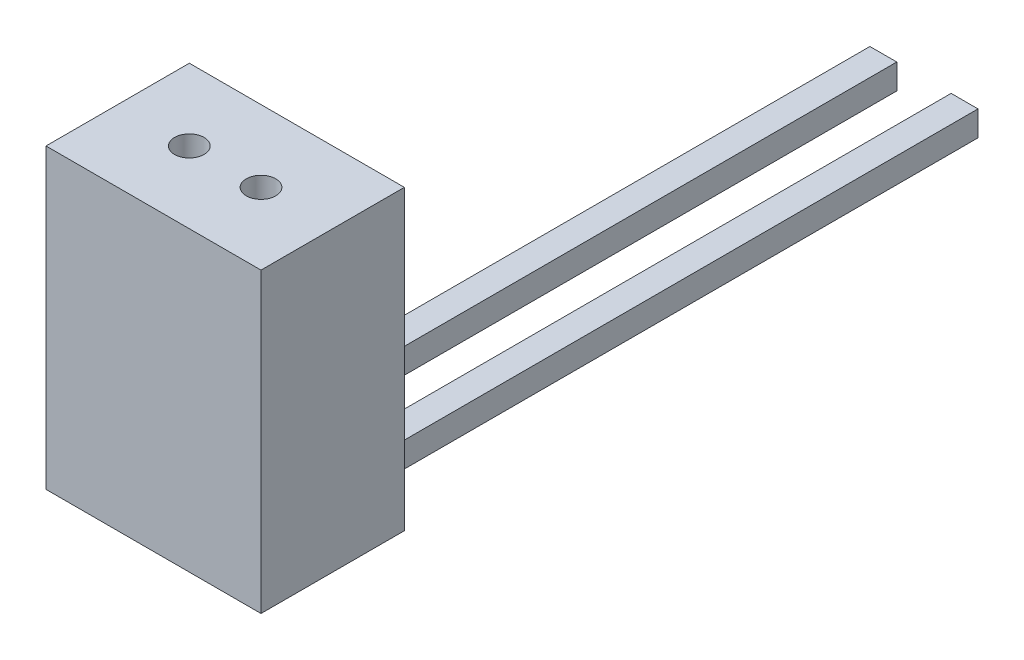
ISO-10303-21;
HEADER;
FILE_DESCRIPTION(('STEP AP214'),'2;1');
FILE_NAME('part.step','',(''),(''),'','','');
FILE_SCHEMA(('AUTOMOTIVE_DESIGN { 1 0 10303 214 1 1 1 1 }'));
ENDSEC;
DATA;
#1=APPLICATION_CONTEXT('core data for automotive mechanical design processes');
#2=APPLICATION_PROTOCOL_DEFINITION('international standard','automotive_design',2000,#1);
#3=PRODUCT_CONTEXT('',#1,'mechanical');
#4=PRODUCT('Part','Part','',(#3));
#5=PRODUCT_RELATED_PRODUCT_CATEGORY('part','',(#4));
#6=PRODUCT_DEFINITION_FORMATION('','',#4);
#7=PRODUCT_DEFINITION_CONTEXT('part definition',#1,'design');
#8=PRODUCT_DEFINITION('design','',#6,#7);
#9=PRODUCT_DEFINITION_SHAPE('','',#8);
#10=(LENGTH_UNIT() NAMED_UNIT(*) SI_UNIT(.MILLI.,.METRE.));
#11=(NAMED_UNIT(*) PLANE_ANGLE_UNIT() SI_UNIT($,.RADIAN.));
#12=(NAMED_UNIT(*) SI_UNIT($,.STERADIAN.) SOLID_ANGLE_UNIT());
#13=UNCERTAINTY_MEASURE_WITH_UNIT(LENGTH_MEASURE(1.E-05),#10,'distance_accuracy_value','');
#14=(GEOMETRIC_REPRESENTATION_CONTEXT(3) GLOBAL_UNCERTAINTY_ASSIGNED_CONTEXT((#13)) GLOBAL_UNIT_ASSIGNED_CONTEXT((#10,
#11,#12)) REPRESENTATION_CONTEXT('',''));
#15=CARTESIAN_POINT('',(0.,0.,0.));
#16=DIRECTION('',(0.,0.,1.));
#17=DIRECTION('',(1.,0.,0.));
#18=AXIS2_PLACEMENT_3D('',#15,#16,#17);
#19=CARTESIAN_POINT('',(16.,33.2,8.));
#20=DIRECTION('',(0.,-1.,0.));
#21=DIRECTION('',(0.,0.,-1.));
#22=AXIS2_PLACEMENT_3D('',#19,#20,#21);
#23=CYLINDRICAL_SURFACE('',#22,1.65);
#24=CARTESIAN_POINT('',(16.,0.,8.));
#25=DIRECTION('',(0.,1.,0.));
#26=DIRECTION('',(0.,0.,1.));
#27=AXIS2_PLACEMENT_3D('',#24,#25,#26);
#28=CIRCLE('',#27,1.65);
#29=CARTESIAN_POINT('',(16.,0.,9.65));
#30=VERTEX_POINT('',#29);
#31=EDGE_CURVE('E295',#30,#30,#28,.T.);
#32=ORIENTED_EDGE('',*,*,#31,.F.);
#33=EDGE_LOOP('',(#32));
#34=FACE_BOUND('',#33,.T.);
#35=CARTESIAN_POINT('',(16.,3.,8.));
#36=DIRECTION('',(0.,1.,0.));
#37=DIRECTION('',(0.,0.,1.));
#38=AXIS2_PLACEMENT_3D('',#35,#36,#37);
#39=CIRCLE('',#38,1.65);
#40=CARTESIAN_POINT('',(16.,3.,9.65));
#41=VERTEX_POINT('',#40);
#42=EDGE_CURVE('E383',#41,#41,#39,.T.);
#43=ORIENTED_EDGE('',*,*,#42,.T.);
#44=EDGE_LOOP('',(#43));
#45=FACE_BOUND('',#44,.T.);
#46=ADVANCED_FACE('F38',(#34,#45),#23,.F.);
#47=CARTESIAN_POINT('',(8.,33.2,8.));
#48=DIRECTION('',(0.,-1.,0.));
#49=DIRECTION('',(0.,0.,-1.));
#50=AXIS2_PLACEMENT_3D('',#47,#48,#49);
#51=CYLINDRICAL_SURFACE('',#50,1.65);
#52=CARTESIAN_POINT('',(8.,0.,8.));
#53=DIRECTION('',(0.,1.,0.));
#54=DIRECTION('',(0.,0.,1.));
#55=AXIS2_PLACEMENT_3D('',#52,#53,#54);
#56=CIRCLE('',#55,1.65);
#57=CARTESIAN_POINT('',(8.,0.,9.65000000000001));
#58=VERTEX_POINT('',#57);
#59=EDGE_CURVE('E292',#58,#58,#56,.T.);
#60=ORIENTED_EDGE('',*,*,#59,.F.);
#61=EDGE_LOOP('',(#60));
#62=FACE_BOUND('',#61,.T.);
#63=CARTESIAN_POINT('',(8.,3.,8.));
#64=DIRECTION('',(0.,1.,0.));
#65=DIRECTION('',(0.,0.,1.));
#66=AXIS2_PLACEMENT_3D('',#63,#64,#65);
#67=CIRCLE('',#66,1.65);
#68=CARTESIAN_POINT('',(8.,3.,9.65000000000001));
#69=VERTEX_POINT('',#68);
#70=EDGE_CURVE('E233',#69,#69,#67,.T.);
#71=ORIENTED_EDGE('',*,*,#70,.T.);
#72=EDGE_LOOP('',(#71));
#73=FACE_BOUND('',#72,.T.);
#74=ADVANCED_FACE('F450',(#62,#73),#51,.F.);
#75=CARTESIAN_POINT('',(8.96666666666667,2.8,-70.));
#76=DIRECTION('',(1.,0.,0.));
#77=DIRECTION('',(0.,0.,-1.));
#78=AXIS2_PLACEMENT_3D('',#75,#76,#77);
#79=PLANE('',#78);
#80=DIRECTION('',(0.,1.,0.));
#81=VECTOR('',#80,1.);
#82=CARTESIAN_POINT('',(8.96666666666667,2.8,0.));
#83=LINE('',#82,#81);
#84=CARTESIAN_POINT('',(8.96666666666667,0.,0.));
#85=VERTEX_POINT('',#84);
#86=CARTESIAN_POINT('',(8.96666666666667,2.8,0.));
#87=VERTEX_POINT('',#86);
#88=EDGE_CURVE('E360',#85,#87,#83,.T.);
#89=ORIENTED_EDGE('',*,*,#88,.F.);
#90=DIRECTION('',(0.,0.,1.));
#91=VECTOR('',#90,1.);
#92=CARTESIAN_POINT('',(8.96666666666667,0.,-70.));
#93=LINE('',#92,#91);
#94=CARTESIAN_POINT('',(8.96666666666667,0.,-70.));
#95=VERTEX_POINT('',#94);
#96=EDGE_CURVE('E11',#95,#85,#93,.T.);
#97=ORIENTED_EDGE('',*,*,#96,.F.);
#98=DIRECTION('',(0.,1.,0.));
#99=VECTOR('',#98,1.);
#100=CARTESIAN_POINT('',(8.96666666666667,2.8,-70.));
#101=LINE('',#100,#99);
#102=CARTESIAN_POINT('',(8.96666666666667,2.8,-70.));
#103=VERTEX_POINT('',#102);
#104=EDGE_CURVE('E361',#95,#103,#101,.T.);
#105=ORIENTED_EDGE('',*,*,#104,.T.);
#106=DIRECTION('',(0.,0.,1.));
#107=VECTOR('',#106,1.);
#108=CARTESIAN_POINT('',(8.96666666666667,2.8,-70.));
#109=LINE('',#108,#107);
#110=EDGE_CURVE('E85',#103,#87,#109,.T.);
#111=ORIENTED_EDGE('',*,*,#110,.T.);
#112=EDGE_LOOP('',(#89,#97,#105,#111));
#113=FACE_BOUND('',#112,.T.);
#114=ADVANCED_FACE('F40',(#113),#79,.T.);
#115=CARTESIAN_POINT('',(5.96666666666667,0.,-70.));
#116=DIRECTION('',(0.,-1.,0.));
#117=DIRECTION('',(0.,0.,-1.));
#118=AXIS2_PLACEMENT_3D('',#115,#116,#117);
#119=PLANE('',#118);
#120=ORIENTED_EDGE('',*,*,#59,.T.);
#121=EDGE_LOOP('',(#120));
#122=FACE_BOUND('',#121,.T.);
#123=ORIENTED_EDGE('',*,*,#31,.T.);
#124=EDGE_LOOP('',(#123));
#125=FACE_BOUND('',#124,.T.);
#126=ORIENTED_EDGE('',*,*,#96,.T.);
#127=DIRECTION('',(1.,0.,0.));
#128=VECTOR('',#127,1.);
#129=CARTESIAN_POINT('',(0.,0.,0.));
#130=LINE('',#129,#128);
#131=CARTESIAN_POINT('',(15.0333333333333,0.,0.));
#132=VERTEX_POINT('',#131);
#133=EDGE_CURVE('E346',#85,#132,#130,.T.);
#134=ORIENTED_EDGE('',*,*,#133,.T.);
#135=DIRECTION('',(0.,0.,1.));
#136=VECTOR('',#135,1.);
#137=CARTESIAN_POINT('',(15.0333333333333,0.,-70.));
#138=LINE('',#137,#136);
#139=CARTESIAN_POINT('',(15.0333333333333,0.,-70.));
#140=VERTEX_POINT('',#139);
#141=EDGE_CURVE('E306',#140,#132,#138,.T.);
#142=ORIENTED_EDGE('',*,*,#141,.F.);
#143=DIRECTION('',(1.,0.,0.));
#144=VECTOR('',#143,1.);
#145=CARTESIAN_POINT('',(15.0333333333333,0.,-70.));
#146=LINE('',#145,#144);
#147=CARTESIAN_POINT('',(18.0333333333333,0.,-70.));
#148=VERTEX_POINT('',#147);
#149=EDGE_CURVE('E303',#140,#148,#146,.T.);
#150=ORIENTED_EDGE('',*,*,#149,.T.);
#151=DIRECTION('',(0.,0.,1.));
#152=VECTOR('',#151,1.);
#153=CARTESIAN_POINT('',(18.0333333333333,0.,-70.));
#154=LINE('',#153,#152);
#155=CARTESIAN_POINT('',(18.0333333333333,0.,0.));
#156=VERTEX_POINT('',#155);
#157=EDGE_CURVE('E291',#148,#156,#154,.T.);
#158=ORIENTED_EDGE('',*,*,#157,.T.);
#159=CARTESIAN_POINT('',(24.,0.,0.));
#160=VERTEX_POINT('',#159);
#161=EDGE_CURVE('E341',#156,#160,#130,.T.);
#162=ORIENTED_EDGE('',*,*,#161,.T.);
#163=DIRECTION('',(0.,0.,-1.));
#164=VECTOR('',#163,1.);
#165=CARTESIAN_POINT('',(24.,0.,16.));
#166=LINE('',#165,#164);
#167=CARTESIAN_POINT('',(24.,0.,16.));
#168=VERTEX_POINT('',#167);
#169=EDGE_CURVE('E354',#168,#160,#166,.T.);
#170=ORIENTED_EDGE('',*,*,#169,.F.);
#171=DIRECTION('',(1.,0.,0.));
#172=VECTOR('',#171,1.);
#173=CARTESIAN_POINT('',(0.,0.,16.));
#174=LINE('',#173,#172);
#175=CARTESIAN_POINT('',(0.,0.,16.));
#176=VERTEX_POINT('',#175);
#177=EDGE_CURVE('E331',#176,#168,#174,.T.);
#178=ORIENTED_EDGE('',*,*,#177,.F.);
#179=DIRECTION('',(0.,0.,-1.));
#180=VECTOR('',#179,1.);
#181=CARTESIAN_POINT('',(0.,0.,16.));
#182=LINE('',#181,#180);
#183=CARTESIAN_POINT('',(0.,0.,0.));
#184=VERTEX_POINT('',#183);
#185=EDGE_CURVE('E357',#176,#184,#182,.T.);
#186=ORIENTED_EDGE('',*,*,#185,.T.);
#187=CARTESIAN_POINT('',(5.96666666666667,0.,0.));
#188=VERTEX_POINT('',#187);
#189=EDGE_CURVE('E342',#184,#188,#130,.T.);
#190=ORIENTED_EDGE('',*,*,#189,.T.);
#191=DIRECTION('',(0.,0.,1.));
#192=VECTOR('',#191,1.);
#193=CARTESIAN_POINT('',(5.96666666666667,0.,-70.));
#194=LINE('',#193,#192);
#195=CARTESIAN_POINT('',(5.96666666666667,0.,-70.));
#196=VERTEX_POINT('',#195);
#197=EDGE_CURVE('E47',#196,#188,#194,.T.);
#198=ORIENTED_EDGE('',*,*,#197,.F.);
#199=DIRECTION('',(1.,0.,0.));
#200=VECTOR('',#199,1.);
#201=CARTESIAN_POINT('',(5.96666666666667,0.,-70.));
#202=LINE('',#201,#200);
#203=EDGE_CURVE('E369',#196,#95,#202,.T.);
#204=ORIENTED_EDGE('',*,*,#203,.T.);
#205=EDGE_LOOP('',(#126,#134,#142,#150,#158,#162,#170,#178,#186,#190,#198,#204));
#206=FACE_BOUND('',#205,.T.);
#207=ADVANCED_FACE('F422',(#122,#125,#206),#119,.T.);
#208=CARTESIAN_POINT('',(5.96666666666667,0.,-70.));
#209=DIRECTION('',(-1.,0.,0.));
#210=DIRECTION('',(0.,0.,1.));
#211=AXIS2_PLACEMENT_3D('',#208,#209,#210);
#212=PLANE('',#211);
#213=DIRECTION('',(0.,-1.,0.));
#214=VECTOR('',#213,1.);
#215=CARTESIAN_POINT('',(5.96666666666667,0.,0.));
#216=LINE('',#215,#214);
#217=CARTESIAN_POINT('',(5.96666666666667,2.8,0.));
#218=VERTEX_POINT('',#217);
#219=EDGE_CURVE('E364',#218,#188,#216,.T.);
#220=ORIENTED_EDGE('',*,*,#219,.F.);
#221=DIRECTION('',(0.,0.,1.));
#222=VECTOR('',#221,1.);
#223=CARTESIAN_POINT('',(5.96666666666667,2.8,-70.));
#224=LINE('',#223,#222);
#225=CARTESIAN_POINT('',(5.96666666666667,2.8,-70.));
#226=VERTEX_POINT('',#225);
#227=EDGE_CURVE('E379',#226,#218,#224,.T.);
#228=ORIENTED_EDGE('',*,*,#227,.F.);
#229=DIRECTION('',(0.,-1.,0.));
#230=VECTOR('',#229,1.);
#231=CARTESIAN_POINT('',(5.96666666666667,0.,-70.));
#232=LINE('',#231,#230);
#233=EDGE_CURVE('E366',#226,#196,#232,.T.);
#234=ORIENTED_EDGE('',*,*,#233,.T.);
#235=ORIENTED_EDGE('',*,*,#197,.T.);
#236=EDGE_LOOP('',(#220,#228,#234,#235));
#237=FACE_BOUND('',#236,.T.);
#238=ADVANCED_FACE('F705',(#237),#212,.T.);
#239=CARTESIAN_POINT('',(5.96666666666667,2.8,-70.));
#240=DIRECTION('',(0.,1.,0.));
#241=DIRECTION('',(0.,0.,1.));
#242=AXIS2_PLACEMENT_3D('',#239,#240,#241);
#243=PLANE('',#242);
#244=DIRECTION('',(-1.,0.,0.));
#245=VECTOR('',#244,1.);
#246=CARTESIAN_POINT('',(5.96666666666667,2.8,0.));
#247=LINE('',#246,#245);
#248=EDGE_CURVE('E373',#87,#218,#247,.T.);
#249=ORIENTED_EDGE('',*,*,#248,.F.);
#250=ORIENTED_EDGE('',*,*,#110,.F.);
#251=DIRECTION('',(-1.,0.,0.));
#252=VECTOR('',#251,1.);
#253=CARTESIAN_POINT('',(5.96666666666667,2.8,-70.));
#254=LINE('',#253,#252);
#255=EDGE_CURVE('E363',#103,#226,#254,.T.);
#256=ORIENTED_EDGE('',*,*,#255,.T.);
#257=ORIENTED_EDGE('',*,*,#227,.T.);
#258=EDGE_LOOP('',(#249,#250,#256,#257));
#259=FACE_BOUND('',#258,.T.);
#260=ADVANCED_FACE('F696',(#259),#243,.T.);
#261=CARTESIAN_POINT('',(0.,0.,-70.));
#262=DIRECTION('',(0.,0.,1.));
#263=DIRECTION('',(1.,0.,0.));
#264=AXIS2_PLACEMENT_3D('',#261,#262,#263);
#265=PLANE('',#264);
#266=ORIENTED_EDGE('',*,*,#104,.F.);
#267=ORIENTED_EDGE('',*,*,#203,.F.);
#268=ORIENTED_EDGE('',*,*,#233,.F.);
#269=ORIENTED_EDGE('',*,*,#255,.F.);
#270=EDGE_LOOP('',(#266,#267,#268,#269));
#271=FACE_BOUND('',#270,.T.);
#272=ADVANCED_FACE('F660',(#271),#265,.F.);
#273=CARTESIAN_POINT('',(0.,0.,0.));
#274=DIRECTION('',(0.,0.,1.));
#275=DIRECTION('',(1.,0.,0.));
#276=AXIS2_PLACEMENT_3D('',#273,#274,#275);
#277=PLANE('',#276);
#278=ORIENTED_EDGE('',*,*,#161,.F.);
#279=DIRECTION('',(0.,1.,0.));
#280=VECTOR('',#279,1.);
#281=CARTESIAN_POINT('',(18.0333333333333,2.8,0.));
#282=LINE('',#281,#280);
#283=CARTESIAN_POINT('',(18.0333333333333,2.8,0.));
#284=VERTEX_POINT('',#283);
#285=EDGE_CURVE('E314',#156,#284,#282,.T.);
#286=ORIENTED_EDGE('',*,*,#285,.T.);
#287=DIRECTION('',(-1.,0.,0.));
#288=VECTOR('',#287,1.);
#289=CARTESIAN_POINT('',(15.0333333333333,2.8,0.));
#290=LINE('',#289,#288);
#291=CARTESIAN_POINT('',(15.0333333333333,2.8,0.));
#292=VERTEX_POINT('',#291);
#293=EDGE_CURVE('E310',#284,#292,#290,.T.);
#294=ORIENTED_EDGE('',*,*,#293,.T.);
#295=DIRECTION('',(0.,-1.,0.));
#296=VECTOR('',#295,1.);
#297=CARTESIAN_POINT('',(15.0333333333333,0.,0.));
#298=LINE('',#297,#296);
#299=EDGE_CURVE('E55',#292,#132,#298,.T.);
#300=ORIENTED_EDGE('',*,*,#299,.T.);
#301=ORIENTED_EDGE('',*,*,#133,.F.);
#302=ORIENTED_EDGE('',*,*,#88,.T.);
#303=ORIENTED_EDGE('',*,*,#248,.T.);
#304=ORIENTED_EDGE('',*,*,#219,.T.);
#305=ORIENTED_EDGE('',*,*,#189,.F.);
#306=DIRECTION('',(0.,-1.,0.));
#307=VECTOR('',#306,1.);
#308=CARTESIAN_POINT('',(0.,33.2,0.));
#309=LINE('',#308,#307);
#310=CARTESIAN_POINT('',(0.,33.2,0.));
#311=VERTEX_POINT('',#310);
#312=EDGE_CURVE('E317',#311,#184,#309,.T.);
#313=ORIENTED_EDGE('',*,*,#312,.F.);
#314=DIRECTION('',(-1.,0.,0.));
#315=VECTOR('',#314,1.);
#316=CARTESIAN_POINT('',(24.,33.2,0.));
#317=LINE('',#316,#315);
#318=CARTESIAN_POINT('',(24.,33.2,0.));
#319=VERTEX_POINT('',#318);
#320=EDGE_CURVE('E332',#319,#311,#317,.T.);
#321=ORIENTED_EDGE('',*,*,#320,.F.);
#322=DIRECTION('',(0.,1.,0.));
#323=VECTOR('',#322,1.);
#324=CARTESIAN_POINT('',(24.,0.,0.));
#325=LINE('',#324,#323);
#326=EDGE_CURVE('E345',#160,#319,#325,.T.);
#327=ORIENTED_EDGE('',*,*,#326,.F.);
#328=EDGE_LOOP('',(#278,#286,#294,#300,#301,#302,#303,#304,#305,#313,#321,#327));
#329=FACE_BOUND('',#328,.T.);
#330=ADVANCED_FACE('F420',(#329),#277,.F.);
#331=CARTESIAN_POINT('',(0.,33.2,16.));
#332=DIRECTION('',(1.,0.,0.));
#333=DIRECTION('',(0.,1.,0.));
#334=AXIS2_PLACEMENT_3D('',#331,#332,#333);
#335=PLANE('',#334);
#336=ORIENTED_EDGE('',*,*,#312,.T.);
#337=ORIENTED_EDGE('',*,*,#185,.F.);
#338=DIRECTION('',(0.,-1.,0.));
#339=VECTOR('',#338,1.);
#340=CARTESIAN_POINT('',(0.,33.2,16.));
#341=LINE('',#340,#339);
#342=CARTESIAN_POINT('',(0.,33.2,16.));
#343=VERTEX_POINT('',#342);
#344=EDGE_CURVE('E328',#343,#176,#341,.T.);
#345=ORIENTED_EDGE('',*,*,#344,.F.);
#346=DIRECTION('',(0.,0.,-1.));
#347=VECTOR('',#346,1.);
#348=CARTESIAN_POINT('',(0.,33.2,16.));
#349=LINE('',#348,#347);
#350=EDGE_CURVE('E338',#343,#311,#349,.T.);
#351=ORIENTED_EDGE('',*,*,#350,.T.);
#352=EDGE_LOOP('',(#336,#337,#345,#351));
#353=FACE_BOUND('',#352,.T.);
#354=ADVANCED_FACE('F417',(#353),#335,.F.);
#355=CARTESIAN_POINT('',(24.,0.,16.));
#356=DIRECTION('',(-1.,0.,0.));
#357=DIRECTION('',(0.,0.,1.));
#358=AXIS2_PLACEMENT_3D('',#355,#356,#357);
#359=PLANE('',#358);
#360=ORIENTED_EDGE('',*,*,#326,.T.);
#361=DIRECTION('',(0.,0.,-1.));
#362=VECTOR('',#361,1.);
#363=CARTESIAN_POINT('',(24.,33.2,16.));
#364=LINE('',#363,#362);
#365=CARTESIAN_POINT('',(24.,33.2,16.));
#366=VERTEX_POINT('',#365);
#367=EDGE_CURVE('E351',#366,#319,#364,.T.);
#368=ORIENTED_EDGE('',*,*,#367,.F.);
#369=DIRECTION('',(0.,1.,0.));
#370=VECTOR('',#369,1.);
#371=CARTESIAN_POINT('',(24.,0.,16.));
#372=LINE('',#371,#370);
#373=EDGE_CURVE('E334',#168,#366,#372,.T.);
#374=ORIENTED_EDGE('',*,*,#373,.F.);
#375=ORIENTED_EDGE('',*,*,#169,.T.);
#376=EDGE_LOOP('',(#360,#368,#374,#375));
#377=FACE_BOUND('',#376,.T.);
#378=ADVANCED_FACE('F405',(#377),#359,.F.);
#379=CARTESIAN_POINT('',(24.,33.2,16.));
#380=DIRECTION('',(0.,-1.,0.));
#381=DIRECTION('',(1.,0.,0.));
#382=AXIS2_PLACEMENT_3D('',#379,#380,#381);
#383=PLANE('',#382);
#384=CARTESIAN_POINT('',(8.,33.2,8.));
#385=DIRECTION('',(0.,1.,0.));
#386=DIRECTION('',(0.,0.,1.));
#387=AXIS2_PLACEMENT_3D('',#384,#385,#386);
#388=CIRCLE('',#387,1.65);
#389=CARTESIAN_POINT('',(8.,33.2,9.65000000000001));
#390=VERTEX_POINT('',#389);
#391=EDGE_CURVE('E288',#390,#390,#388,.T.);
#392=ORIENTED_EDGE('',*,*,#391,.F.);
#393=EDGE_LOOP('',(#392));
#394=FACE_BOUND('',#393,.T.);
#395=CARTESIAN_POINT('',(16.,33.2,8.));
#396=DIRECTION('',(0.,1.,0.));
#397=DIRECTION('',(0.,0.,1.));
#398=AXIS2_PLACEMENT_3D('',#395,#396,#397);
#399=CIRCLE('',#398,1.65);
#400=CARTESIAN_POINT('',(16.,33.2,9.65));
#401=VERTEX_POINT('',#400);
#402=EDGE_CURVE('E298',#401,#401,#399,.T.);
#403=ORIENTED_EDGE('',*,*,#402,.F.);
#404=EDGE_LOOP('',(#403));
#405=FACE_BOUND('',#404,.T.);
#406=ORIENTED_EDGE('',*,*,#320,.T.);
#407=ORIENTED_EDGE('',*,*,#350,.F.);
#408=DIRECTION('',(-1.,0.,0.));
#409=VECTOR('',#408,1.);
#410=CARTESIAN_POINT('',(24.,33.2,16.));
#411=LINE('',#410,#409);
#412=EDGE_CURVE('E336',#366,#343,#411,.T.);
#413=ORIENTED_EDGE('',*,*,#412,.F.);
#414=ORIENTED_EDGE('',*,*,#367,.T.);
#415=EDGE_LOOP('',(#406,#407,#413,#414));
#416=FACE_BOUND('',#415,.T.);
#417=ADVANCED_FACE('F401',(#394,#405,#416),#383,.F.);
#418=CARTESIAN_POINT('',(0.,0.,16.));
#419=DIRECTION('',(0.,0.,1.));
#420=DIRECTION('',(1.,0.,0.));
#421=AXIS2_PLACEMENT_3D('',#418,#419,#420);
#422=PLANE('',#421);
#423=ORIENTED_EDGE('',*,*,#344,.T.);
#424=ORIENTED_EDGE('',*,*,#177,.T.);
#425=ORIENTED_EDGE('',*,*,#373,.T.);
#426=ORIENTED_EDGE('',*,*,#412,.T.);
#427=EDGE_LOOP('',(#423,#424,#425,#426));
#428=FACE_BOUND('',#427,.T.);
#429=ADVANCED_FACE('F404',(#428),#422,.T.);
#430=CARTESIAN_POINT('',(18.0333333333333,2.8,-70.));
#431=DIRECTION('',(1.,0.,0.));
#432=DIRECTION('',(0.,0.,-1.));
#433=AXIS2_PLACEMENT_3D('',#430,#431,#432);
#434=PLANE('',#433);
#435=ORIENTED_EDGE('',*,*,#285,.F.);
#436=ORIENTED_EDGE('',*,*,#157,.F.);
#437=DIRECTION('',(0.,1.,0.));
#438=VECTOR('',#437,1.);
#439=CARTESIAN_POINT('',(18.0333333333333,2.8,-70.));
#440=LINE('',#439,#438);
#441=CARTESIAN_POINT('',(18.0333333333333,2.8,-70.));
#442=VERTEX_POINT('',#441);
#443=EDGE_CURVE('E311',#148,#442,#440,.T.);
#444=ORIENTED_EDGE('',*,*,#443,.T.);
#445=DIRECTION('',(0.,0.,1.));
#446=VECTOR('',#445,1.);
#447=CARTESIAN_POINT('',(18.0333333333333,2.8,-70.));
#448=LINE('',#447,#446);
#449=EDGE_CURVE('E301',#442,#284,#448,.T.);
#450=ORIENTED_EDGE('',*,*,#449,.T.);
#451=EDGE_LOOP('',(#435,#436,#444,#450));
#452=FACE_BOUND('',#451,.T.);
#453=ADVANCED_FACE('F439',(#452),#434,.T.);
#454=CARTESIAN_POINT('',(15.0333333333333,0.,-70.));
#455=DIRECTION('',(-1.,0.,0.));
#456=DIRECTION('',(0.,0.,1.));
#457=AXIS2_PLACEMENT_3D('',#454,#455,#456);
#458=PLANE('',#457);
#459=ORIENTED_EDGE('',*,*,#299,.F.);
#460=DIRECTION('',(0.,0.,1.));
#461=VECTOR('',#460,1.);
#462=CARTESIAN_POINT('',(15.0333333333333,2.8,-70.));
#463=LINE('',#462,#461);
#464=CARTESIAN_POINT('',(15.0333333333333,2.8,-70.));
#465=VERTEX_POINT('',#464);
#466=EDGE_CURVE('E304',#465,#292,#463,.T.);
#467=ORIENTED_EDGE('',*,*,#466,.F.);
#468=DIRECTION('',(0.,-1.,0.));
#469=VECTOR('',#468,1.);
#470=CARTESIAN_POINT('',(15.0333333333333,0.,-70.));
#471=LINE('',#470,#469);
#472=EDGE_CURVE('E320',#465,#140,#471,.T.);
#473=ORIENTED_EDGE('',*,*,#472,.T.);
#474=ORIENTED_EDGE('',*,*,#141,.T.);
#475=EDGE_LOOP('',(#459,#467,#473,#474));
#476=FACE_BOUND('',#475,.T.);
#477=ADVANCED_FACE('F434',(#476),#458,.T.);
#478=CARTESIAN_POINT('',(15.0333333333333,2.8,-70.));
#479=DIRECTION('',(0.,1.,0.));
#480=DIRECTION('',(0.,0.,1.));
#481=AXIS2_PLACEMENT_3D('',#478,#479,#480);
#482=PLANE('',#481);
#483=ORIENTED_EDGE('',*,*,#293,.F.);
#484=ORIENTED_EDGE('',*,*,#449,.F.);
#485=DIRECTION('',(-1.,0.,0.));
#486=VECTOR('',#485,1.);
#487=CARTESIAN_POINT('',(15.0333333333333,2.8,-70.));
#488=LINE('',#487,#486);
#489=EDGE_CURVE('E323',#442,#465,#488,.T.);
#490=ORIENTED_EDGE('',*,*,#489,.T.);
#491=ORIENTED_EDGE('',*,*,#466,.T.);
#492=EDGE_LOOP('',(#483,#484,#490,#491));
#493=FACE_BOUND('',#492,.T.);
#494=ADVANCED_FACE('F431',(#493),#482,.T.);
#495=CARTESIAN_POINT('',(0.,0.,-70.));
#496=DIRECTION('',(0.,0.,1.));
#497=DIRECTION('',(1.,0.,0.));
#498=AXIS2_PLACEMENT_3D('',#495,#496,#497);
#499=PLANE('',#498);
#500=ORIENTED_EDGE('',*,*,#443,.F.);
#501=ORIENTED_EDGE('',*,*,#149,.F.);
#502=ORIENTED_EDGE('',*,*,#472,.F.);
#503=ORIENTED_EDGE('',*,*,#489,.F.);
#504=EDGE_LOOP('',(#500,#501,#502,#503));
#505=FACE_BOUND('',#504,.T.);
#506=ADVANCED_FACE('F397',(#505),#499,.F.);
#507=CARTESIAN_POINT('',(16.,5.8,8.));
#508=DIRECTION('',(0.,1.,0.));
#509=DIRECTION('',(0.,0.,1.));
#510=AXIS2_PLACEMENT_3D('',#507,#508,#509);
#511=CIRCLE('',#510,1.65);
#512=CARTESIAN_POINT('',(16.,5.8,9.65));
#513=VERTEX_POINT('',#512);
#514=EDGE_CURVE('E42',#513,#513,#511,.T.);
#515=ORIENTED_EDGE('',*,*,#514,.F.);
#516=EDGE_LOOP('',(#515));
#517=FACE_BOUND('',#516,.T.);
#518=ORIENTED_EDGE('',*,*,#402,.T.);
#519=EDGE_LOOP('',(#518));
#520=FACE_BOUND('',#519,.T.);
#521=ADVANCED_FACE('F393',(#517,#520),#23,.F.);
#522=CARTESIAN_POINT('',(8.,5.8,8.));
#523=DIRECTION('',(0.,1.,0.));
#524=DIRECTION('',(0.,0.,1.));
#525=AXIS2_PLACEMENT_3D('',#522,#523,#524);
#526=CIRCLE('',#525,1.65);
#527=CARTESIAN_POINT('',(8.,5.8,9.65000000000001));
#528=VERTEX_POINT('',#527);
#529=EDGE_CURVE('E237',#528,#528,#526,.T.);
#530=ORIENTED_EDGE('',*,*,#529,.F.);
#531=EDGE_LOOP('',(#530));
#532=FACE_BOUND('',#531,.T.);
#533=ORIENTED_EDGE('',*,*,#391,.T.);
#534=EDGE_LOOP('',(#533));
#535=FACE_BOUND('',#534,.T.);
#536=ADVANCED_FACE('F396',(#532,#535),#51,.F.);
#537=CARTESIAN_POINT('',(9.64544826719043,5.8,10.85));
#538=DIRECTION('',(-0.866025403784439,0.,-0.5));
#539=DIRECTION('',(-0.5,0.,0.866025403784439));
#540=AXIS2_PLACEMENT_3D('',#537,#538,#539);
#541=PLANE('',#540);
#542=DIRECTION('',(0.5,0.,-0.866025403784439));
#543=VECTOR('',#542,1.);
#544=CARTESIAN_POINT('',(9.64544826719043,3.,10.85));
#545=LINE('',#544,#543);
#546=CARTESIAN_POINT('',(9.64544826719043,3.,10.85));
#547=VERTEX_POINT('',#546);
#548=CARTESIAN_POINT('',(11.2908965343809,3.,8.));
#549=VERTEX_POINT('',#548);
#550=EDGE_CURVE('E276',#547,#549,#545,.T.);
#551=ORIENTED_EDGE('',*,*,#550,.F.);
#552=DIRECTION('',(0.,-1.,0.));
#553=VECTOR('',#552,1.);
#554=CARTESIAN_POINT('',(9.64544826719043,5.8,10.85));
#555=LINE('',#554,#553);
#556=CARTESIAN_POINT('',(9.64544826719043,5.8,10.85));
#557=VERTEX_POINT('',#556);
#558=EDGE_CURVE('E228',#557,#547,#555,.T.);
#559=ORIENTED_EDGE('',*,*,#558,.F.);
#560=DIRECTION('',(0.5,0.,-0.866025403784439));
#561=VECTOR('',#560,1.);
#562=CARTESIAN_POINT('',(9.64544826719043,5.8,10.85));
#563=LINE('',#562,#561);
#564=CARTESIAN_POINT('',(11.2908965343809,5.8,8.));
#565=VERTEX_POINT('',#564);
#566=EDGE_CURVE('E212',#557,#565,#563,.T.);
#567=ORIENTED_EDGE('',*,*,#566,.T.);
#568=DIRECTION('',(0.,-1.,0.));
#569=VECTOR('',#568,1.);
#570=CARTESIAN_POINT('',(11.2908965343809,5.8,8.));
#571=LINE('',#570,#569);
#572=EDGE_CURVE('E225',#565,#549,#571,.T.);
#573=ORIENTED_EDGE('',*,*,#572,.T.);
#574=EDGE_LOOP('',(#551,#559,#567,#573));
#575=FACE_BOUND('',#574,.T.);
#576=ADVANCED_FACE('F224',(#575),#541,.T.);
#577=CARTESIAN_POINT('',(11.2908965343809,5.8,8.));
#578=DIRECTION('',(-0.866025403784439,0.,0.5));
#579=DIRECTION('',(0.5,0.,0.866025403784439));
#580=AXIS2_PLACEMENT_3D('',#577,#578,#579);
#581=PLANE('',#580);
#582=DIRECTION('',(-0.5,0.,-0.866025403784439));
#583=VECTOR('',#582,1.);
#584=CARTESIAN_POINT('',(11.2908965343809,3.,8.));
#585=LINE('',#584,#583);
#586=CARTESIAN_POINT('',(9.64544826719043,3.,5.15));
#587=VERTEX_POINT('',#586);
#588=EDGE_CURVE('E232',#549,#587,#585,.T.);
#589=ORIENTED_EDGE('',*,*,#588,.F.);
#590=ORIENTED_EDGE('',*,*,#572,.F.);
#591=DIRECTION('',(-0.5,0.,-0.866025403784439));
#592=VECTOR('',#591,1.);
#593=CARTESIAN_POINT('',(11.2908965343809,5.8,8.));
#594=LINE('',#593,#592);
#595=CARTESIAN_POINT('',(9.64544826719043,5.8,5.15));
#596=VERTEX_POINT('',#595);
#597=EDGE_CURVE('E208',#565,#596,#594,.T.);
#598=ORIENTED_EDGE('',*,*,#597,.T.);
#599=DIRECTION('',(0.,-1.,0.));
#600=VECTOR('',#599,1.);
#601=CARTESIAN_POINT('',(9.64544826719043,5.8,5.15));
#602=LINE('',#601,#600);
#603=EDGE_CURVE('E234',#596,#587,#602,.T.);
#604=ORIENTED_EDGE('',*,*,#603,.T.);
#605=EDGE_LOOP('',(#589,#590,#598,#604));
#606=FACE_BOUND('',#605,.T.);
#607=ADVANCED_FACE('F231',(#606),#581,.T.);
#608=CARTESIAN_POINT('',(9.64544826719043,5.8,5.15));
#609=DIRECTION('',(0.,0.,1.));
#610=DIRECTION('',(1.,0.,0.));
#611=AXIS2_PLACEMENT_3D('',#608,#609,#610);
#612=PLANE('',#611);
#613=DIRECTION('',(-1.,0.,0.));
#614=VECTOR('',#613,1.);
#615=CARTESIAN_POINT('',(9.64544826719043,3.,5.15));
#616=LINE('',#615,#614);
#617=CARTESIAN_POINT('',(6.35455173280956,3.,5.15));
#618=VERTEX_POINT('',#617);
#619=EDGE_CURVE('E751',#587,#618,#616,.T.);
#620=ORIENTED_EDGE('',*,*,#619,.F.);
#621=ORIENTED_EDGE('',*,*,#603,.F.);
#622=DIRECTION('',(-1.,0.,0.));
#623=VECTOR('',#622,1.);
#624=CARTESIAN_POINT('',(9.64544826719043,5.8,5.15));
#625=LINE('',#624,#623);
#626=CARTESIAN_POINT('',(6.35455173280956,5.8,5.15));
#627=VERTEX_POINT('',#626);
#628=EDGE_CURVE('E214',#596,#627,#625,.T.);
#629=ORIENTED_EDGE('',*,*,#628,.T.);
#630=DIRECTION('',(0.,-1.,0.));
#631=VECTOR('',#630,1.);
#632=CARTESIAN_POINT('',(6.35455173280956,5.8,5.15));
#633=LINE('',#632,#631);
#634=EDGE_CURVE('E239',#627,#618,#633,.T.);
#635=ORIENTED_EDGE('',*,*,#634,.T.);
#636=EDGE_LOOP('',(#620,#621,#629,#635));
#637=FACE_BOUND('',#636,.T.);
#638=ADVANCED_FACE('F496',(#637),#612,.T.);
#639=CARTESIAN_POINT('',(6.35455173280956,5.8,5.15));
#640=DIRECTION('',(0.866025403784439,0.,0.5));
#641=DIRECTION('',(0.5,0.,-0.866025403784439));
#642=AXIS2_PLACEMENT_3D('',#639,#640,#641);
#643=PLANE('',#642);
#644=DIRECTION('',(-0.5,0.,0.866025403784439));
#645=VECTOR('',#644,1.);
#646=CARTESIAN_POINT('',(6.35455173280956,3.,5.15));
#647=LINE('',#646,#645);
#648=CARTESIAN_POINT('',(4.70910346561913,3.,8.));
#649=VERTEX_POINT('',#648);
#650=EDGE_CURVE('E758',#618,#649,#647,.T.);
#651=ORIENTED_EDGE('',*,*,#650,.F.);
#652=ORIENTED_EDGE('',*,*,#634,.F.);
#653=DIRECTION('',(-0.5,0.,0.866025403784439));
#654=VECTOR('',#653,1.);
#655=CARTESIAN_POINT('',(6.35455173280956,5.8,5.15));
#656=LINE('',#655,#654);
#657=CARTESIAN_POINT('',(4.70910346561913,5.8,8.));
#658=VERTEX_POINT('',#657);
#659=EDGE_CURVE('E778',#627,#658,#656,.T.);
#660=ORIENTED_EDGE('',*,*,#659,.T.);
#661=DIRECTION('',(0.,-1.,0.));
#662=VECTOR('',#661,1.);
#663=CARTESIAN_POINT('',(4.70910346561913,5.8,8.));
#664=LINE('',#663,#662);
#665=EDGE_CURVE('E767',#658,#649,#664,.T.);
#666=ORIENTED_EDGE('',*,*,#665,.T.);
#667=EDGE_LOOP('',(#651,#652,#660,#666));
#668=FACE_BOUND('',#667,.T.);
#669=ADVANCED_FACE('F499',(#668),#643,.T.);
#670=CARTESIAN_POINT('',(4.70910346561913,5.8,8.));
#671=DIRECTION('',(0.866025403784438,0.,-0.5));
#672=DIRECTION('',(-0.5,0.,-0.866025403784439));
#673=AXIS2_PLACEMENT_3D('',#670,#671,#672);
#674=PLANE('',#673);
#675=DIRECTION('',(0.5,0.,0.866025403784438));
#676=VECTOR('',#675,1.);
#677=CARTESIAN_POINT('',(4.70910346561913,3.,8.));
#678=LINE('',#677,#676);
#679=CARTESIAN_POINT('',(6.35455173280956,3.,10.85));
#680=VERTEX_POINT('',#679);
#681=EDGE_CURVE('E760',#649,#680,#678,.T.);
#682=ORIENTED_EDGE('',*,*,#681,.F.);
#683=ORIENTED_EDGE('',*,*,#665,.F.);
#684=DIRECTION('',(0.5,0.,0.866025403784438));
#685=VECTOR('',#684,1.);
#686=CARTESIAN_POINT('',(4.70910346561913,5.8,8.));
#687=LINE('',#686,#685);
#688=CARTESIAN_POINT('',(6.35455173280956,5.8,10.85));
#689=VERTEX_POINT('',#688);
#690=EDGE_CURVE('E777',#658,#689,#687,.T.);
#691=ORIENTED_EDGE('',*,*,#690,.T.);
#692=DIRECTION('',(0.,-1.,0.));
#693=VECTOR('',#692,1.);
#694=CARTESIAN_POINT('',(6.35455173280956,5.8,10.85));
#695=LINE('',#694,#693);
#696=EDGE_CURVE('E764',#689,#680,#695,.T.);
#697=ORIENTED_EDGE('',*,*,#696,.T.);
#698=EDGE_LOOP('',(#682,#683,#691,#697));
#699=FACE_BOUND('',#698,.T.);
#700=ADVANCED_FACE('F503',(#699),#674,.T.);
#701=CARTESIAN_POINT('',(6.35455173280956,5.8,10.85));
#702=DIRECTION('',(0.,0.,-1.));
#703=DIRECTION('',(-1.,0.,0.));
#704=AXIS2_PLACEMENT_3D('',#701,#702,#703);
#705=PLANE('',#704);
#706=DIRECTION('',(1.,0.,0.));
#707=VECTOR('',#706,1.);
#708=CARTESIAN_POINT('',(6.35455173280956,3.,10.85));
#709=LINE('',#708,#707);
#710=EDGE_CURVE('E229',#680,#547,#709,.T.);
#711=ORIENTED_EDGE('',*,*,#710,.F.);
#712=ORIENTED_EDGE('',*,*,#696,.F.);
#713=DIRECTION('',(1.,0.,0.));
#714=VECTOR('',#713,1.);
#715=CARTESIAN_POINT('',(6.35455173280956,5.8,10.85));
#716=LINE('',#715,#714);
#717=EDGE_CURVE('E754',#689,#557,#716,.T.);
#718=ORIENTED_EDGE('',*,*,#717,.T.);
#719=ORIENTED_EDGE('',*,*,#558,.T.);
#720=EDGE_LOOP('',(#711,#712,#718,#719));
#721=FACE_BOUND('',#720,.T.);
#722=ADVANCED_FACE('F507',(#721),#705,.T.);
#723=CARTESIAN_POINT('',(0.,5.8,0.));
#724=DIRECTION('',(0.,1.,0.));
#725=DIRECTION('',(0.,0.,1.));
#726=AXIS2_PLACEMENT_3D('',#723,#724,#725);
#727=PLANE('',#726);
#728=ORIENTED_EDGE('',*,*,#529,.T.);
#729=EDGE_LOOP('',(#728));
#730=FACE_BOUND('',#729,.T.);
#731=ORIENTED_EDGE('',*,*,#566,.F.);
#732=ORIENTED_EDGE('',*,*,#717,.F.);
#733=ORIENTED_EDGE('',*,*,#690,.F.);
#734=ORIENTED_EDGE('',*,*,#659,.F.);
#735=ORIENTED_EDGE('',*,*,#628,.F.);
#736=ORIENTED_EDGE('',*,*,#597,.F.);
#737=EDGE_LOOP('',(#731,#732,#733,#734,#735,#736));
#738=FACE_BOUND('',#737,.T.);
#739=ADVANCED_FACE('F210',(#730,#738),#727,.F.);
#740=CARTESIAN_POINT('',(0.,3.,0.));
#741=DIRECTION('',(0.,1.,0.));
#742=DIRECTION('',(0.,0.,1.));
#743=AXIS2_PLACEMENT_3D('',#740,#741,#742);
#744=PLANE('',#743);
#745=ORIENTED_EDGE('',*,*,#70,.F.);
#746=EDGE_LOOP('',(#745));
#747=FACE_BOUND('',#746,.T.);
#748=ORIENTED_EDGE('',*,*,#550,.T.);
#749=ORIENTED_EDGE('',*,*,#588,.T.);
#750=ORIENTED_EDGE('',*,*,#619,.T.);
#751=ORIENTED_EDGE('',*,*,#650,.T.);
#752=ORIENTED_EDGE('',*,*,#681,.T.);
#753=ORIENTED_EDGE('',*,*,#710,.T.);
#754=EDGE_LOOP('',(#748,#749,#750,#751,#752,#753));
#755=FACE_BOUND('',#754,.T.);
#756=ADVANCED_FACE('F490',(#747,#755),#744,.T.);
#757=CARTESIAN_POINT('',(17.6454482671904,5.8,10.85));
#758=DIRECTION('',(-0.866025403784439,0.,-0.499999999999999));
#759=DIRECTION('',(-0.499999999999999,0.,0.866025403784439));
#760=AXIS2_PLACEMENT_3D('',#757,#758,#759);
#761=PLANE('',#760);
#762=DIRECTION('',(0.499999999999999,0.,-0.866025403784439));
#763=VECTOR('',#762,1.);
#764=CARTESIAN_POINT('',(17.6454482671904,3.,10.85));
#765=LINE('',#764,#763);
#766=CARTESIAN_POINT('',(17.6454482671904,3.,10.85));
#767=VERTEX_POINT('',#766);
#768=CARTESIAN_POINT('',(19.2908965343809,3.,8.));
#769=VERTEX_POINT('',#768);
#770=EDGE_CURVE('E273',#767,#769,#765,.T.);
#771=ORIENTED_EDGE('',*,*,#770,.F.);
#772=DIRECTION('',(0.,-1.,0.));
#773=VECTOR('',#772,1.);
#774=CARTESIAN_POINT('',(17.6454482671904,5.8,10.85));
#775=LINE('',#774,#773);
#776=CARTESIAN_POINT('',(17.6454482671904,5.8,10.85));
#777=VERTEX_POINT('',#776);
#778=EDGE_CURVE('E258',#777,#767,#775,.T.);
#779=ORIENTED_EDGE('',*,*,#778,.F.);
#780=DIRECTION('',(0.499999999999999,0.,-0.866025403784439));
#781=VECTOR('',#780,1.);
#782=CARTESIAN_POINT('',(17.6454482671904,5.8,10.85));
#783=LINE('',#782,#781);
#784=CARTESIAN_POINT('',(19.2908965343809,5.8,8.));
#785=VERTEX_POINT('',#784);
#786=EDGE_CURVE('E265',#777,#785,#783,.T.);
#787=ORIENTED_EDGE('',*,*,#786,.T.);
#788=DIRECTION('',(0.,-1.,0.));
#789=VECTOR('',#788,1.);
#790=CARTESIAN_POINT('',(19.2908965343809,5.8,8.));
#791=LINE('',#790,#789);
#792=EDGE_CURVE('E243',#785,#769,#791,.T.);
#793=ORIENTED_EDGE('',*,*,#792,.T.);
#794=EDGE_LOOP('',(#771,#779,#787,#793));
#795=FACE_BOUND('',#794,.T.);
#796=ADVANCED_FACE('F486',(#795),#761,.T.);
#797=CARTESIAN_POINT('',(19.2908965343809,5.8,8.));
#798=DIRECTION('',(-0.866025403784439,0.,0.5));
#799=DIRECTION('',(0.5,0.,0.866025403784439));
#800=AXIS2_PLACEMENT_3D('',#797,#798,#799);
#801=PLANE('',#800);
#802=DIRECTION('',(-0.5,0.,-0.866025403784439));
#803=VECTOR('',#802,1.);
#804=CARTESIAN_POINT('',(19.2908965343809,3.,8.));
#805=LINE('',#804,#803);
#806=CARTESIAN_POINT('',(17.6454482671904,3.,5.15));
#807=VERTEX_POINT('',#806);
#808=EDGE_CURVE('E271',#769,#807,#805,.T.);
#809=ORIENTED_EDGE('',*,*,#808,.F.);
#810=ORIENTED_EDGE('',*,*,#792,.F.);
#811=DIRECTION('',(-0.5,0.,-0.866025403784439));
#812=VECTOR('',#811,1.);
#813=CARTESIAN_POINT('',(19.2908965343809,5.8,8.));
#814=LINE('',#813,#812);
#815=CARTESIAN_POINT('',(17.6454482671904,5.8,5.15));
#816=VERTEX_POINT('',#815);
#817=EDGE_CURVE('E284',#785,#816,#814,.T.);
#818=ORIENTED_EDGE('',*,*,#817,.T.);
#819=DIRECTION('',(0.,-1.,0.));
#820=VECTOR('',#819,1.);
#821=CARTESIAN_POINT('',(17.6454482671904,5.8,5.15));
#822=LINE('',#821,#820);
#823=EDGE_CURVE('E246',#816,#807,#822,.T.);
#824=ORIENTED_EDGE('',*,*,#823,.T.);
#825=EDGE_LOOP('',(#809,#810,#818,#824));
#826=FACE_BOUND('',#825,.T.);
#827=ADVANCED_FACE('F482',(#826),#801,.T.);
#828=CARTESIAN_POINT('',(17.6454482671904,5.8,5.15));
#829=DIRECTION('',(0.,0.,1.));
#830=DIRECTION('',(1.,0.,0.));
#831=AXIS2_PLACEMENT_3D('',#828,#829,#830);
#832=PLANE('',#831);
#833=DIRECTION('',(-1.,0.,0.));
#834=VECTOR('',#833,1.);
#835=CARTESIAN_POINT('',(17.6454482671904,3.,5.15));
#836=LINE('',#835,#834);
#837=CARTESIAN_POINT('',(14.3545517328096,3.,5.15));
#838=VERTEX_POINT('',#837);
#839=EDGE_CURVE('E269',#807,#838,#836,.T.);
#840=ORIENTED_EDGE('',*,*,#839,.F.);
#841=ORIENTED_EDGE('',*,*,#823,.F.);
#842=DIRECTION('',(-1.,0.,0.));
#843=VECTOR('',#842,1.);
#844=CARTESIAN_POINT('',(17.6454482671904,5.8,5.15));
#845=LINE('',#844,#843);
#846=CARTESIAN_POINT('',(14.3545517328096,5.8,5.15));
#847=VERTEX_POINT('',#846);
#848=EDGE_CURVE('E282',#816,#847,#845,.T.);
#849=ORIENTED_EDGE('',*,*,#848,.T.);
#850=DIRECTION('',(0.,-1.,0.));
#851=VECTOR('',#850,1.);
#852=CARTESIAN_POINT('',(14.3545517328096,5.8,5.15));
#853=LINE('',#852,#851);
#854=EDGE_CURVE('E249',#847,#838,#853,.T.);
#855=ORIENTED_EDGE('',*,*,#854,.T.);
#856=EDGE_LOOP('',(#840,#841,#849,#855));
#857=FACE_BOUND('',#856,.T.);
#858=ADVANCED_FACE('F478',(#857),#832,.T.);
#859=CARTESIAN_POINT('',(14.3545517328096,5.8,5.15));
#860=DIRECTION('',(0.866025403784439,0.,0.5));
#861=DIRECTION('',(0.5,0.,-0.866025403784439));
#862=AXIS2_PLACEMENT_3D('',#859,#860,#861);
#863=PLANE('',#862);
#864=DIRECTION('',(-0.5,0.,0.866025403784439));
#865=VECTOR('',#864,1.);
#866=CARTESIAN_POINT('',(14.3545517328096,3.,5.15));
#867=LINE('',#866,#865);
#868=CARTESIAN_POINT('',(12.7091034656191,3.,8.00000000000001));
#869=VERTEX_POINT('',#868);
#870=EDGE_CURVE('E267',#838,#869,#867,.T.);
#871=ORIENTED_EDGE('',*,*,#870,.F.);
#872=ORIENTED_EDGE('',*,*,#854,.F.);
#873=DIRECTION('',(-0.5,0.,0.866025403784439));
#874=VECTOR('',#873,1.);
#875=CARTESIAN_POINT('',(14.3545517328096,5.8,5.15));
#876=LINE('',#875,#874);
#877=CARTESIAN_POINT('',(12.7091034656191,5.8,8.00000000000001));
#878=VERTEX_POINT('',#877);
#879=EDGE_CURVE('E280',#847,#878,#876,.T.);
#880=ORIENTED_EDGE('',*,*,#879,.T.);
#881=DIRECTION('',(0.,-1.,0.));
#882=VECTOR('',#881,1.);
#883=CARTESIAN_POINT('',(12.7091034656191,5.8,8.00000000000001));
#884=LINE('',#883,#882);
#885=EDGE_CURVE('E252',#878,#869,#884,.T.);
#886=ORIENTED_EDGE('',*,*,#885,.T.);
#887=EDGE_LOOP('',(#871,#872,#880,#886));
#888=FACE_BOUND('',#887,.T.);
#889=ADVANCED_FACE('F474',(#888),#863,.T.);
#890=CARTESIAN_POINT('',(12.7091034656191,5.8,8.00000000000001));
#891=DIRECTION('',(0.866025403784438,0.,-0.5));
#892=DIRECTION('',(-0.5,0.,-0.866025403784439));
#893=AXIS2_PLACEMENT_3D('',#890,#891,#892);
#894=PLANE('',#893);
#895=DIRECTION('',(0.5,0.,0.866025403784439));
#896=VECTOR('',#895,1.);
#897=CARTESIAN_POINT('',(12.7091034656191,3.,8.00000000000001));
#898=LINE('',#897,#896);
#899=CARTESIAN_POINT('',(14.3545517328096,3.,10.85));
#900=VERTEX_POINT('',#899);
#901=EDGE_CURVE('E264',#869,#900,#898,.T.);
#902=ORIENTED_EDGE('',*,*,#901,.F.);
#903=ORIENTED_EDGE('',*,*,#885,.F.);
#904=DIRECTION('',(0.5,0.,0.866025403784439));
#905=VECTOR('',#904,1.);
#906=CARTESIAN_POINT('',(12.7091034656191,5.8,8.00000000000001));
#907=LINE('',#906,#905);
#908=CARTESIAN_POINT('',(14.3545517328096,5.8,10.85));
#909=VERTEX_POINT('',#908);
#910=EDGE_CURVE('E278',#878,#909,#907,.T.);
#911=ORIENTED_EDGE('',*,*,#910,.T.);
#912=DIRECTION('',(0.,-1.,0.));
#913=VECTOR('',#912,1.);
#914=CARTESIAN_POINT('',(14.3545517328096,5.8,10.85));
#915=LINE('',#914,#913);
#916=EDGE_CURVE('E255',#909,#900,#915,.T.);
#917=ORIENTED_EDGE('',*,*,#916,.T.);
#918=EDGE_LOOP('',(#902,#903,#911,#917));
#919=FACE_BOUND('',#918,.T.);
#920=ADVANCED_FACE('F470',(#919),#894,.T.);
#921=CARTESIAN_POINT('',(14.3545517328096,5.8,10.85));
#922=DIRECTION('',(0.,0.,-1.));
#923=DIRECTION('',(-1.,0.,0.));
#924=AXIS2_PLACEMENT_3D('',#921,#922,#923);
#925=PLANE('',#924);
#926=DIRECTION('',(1.,0.,0.));
#927=VECTOR('',#926,1.);
#928=CARTESIAN_POINT('',(14.3545517328096,3.,10.85));
#929=LINE('',#928,#927);
#930=EDGE_CURVE('E262',#900,#767,#929,.T.);
#931=ORIENTED_EDGE('',*,*,#930,.F.);
#932=ORIENTED_EDGE('',*,*,#916,.F.);
#933=DIRECTION('',(1.,0.,0.));
#934=VECTOR('',#933,1.);
#935=CARTESIAN_POINT('',(14.3545517328096,5.8,10.85));
#936=LINE('',#935,#934);
#937=EDGE_CURVE('E261',#909,#777,#936,.T.);
#938=ORIENTED_EDGE('',*,*,#937,.T.);
#939=ORIENTED_EDGE('',*,*,#778,.T.);
#940=EDGE_LOOP('',(#931,#932,#938,#939));
#941=FACE_BOUND('',#940,.T.);
#942=ADVANCED_FACE('F464',(#941),#925,.T.);
#943=CARTESIAN_POINT('',(0.,5.8,0.));
#944=DIRECTION('',(0.,1.,0.));
#945=DIRECTION('',(0.,0.,1.));
#946=AXIS2_PLACEMENT_3D('',#943,#944,#945);
#947=PLANE('',#946);
#948=ORIENTED_EDGE('',*,*,#514,.T.);
#949=EDGE_LOOP('',(#948));
#950=FACE_BOUND('',#949,.T.);
#951=ORIENTED_EDGE('',*,*,#786,.F.);
#952=ORIENTED_EDGE('',*,*,#937,.F.);
#953=ORIENTED_EDGE('',*,*,#910,.F.);
#954=ORIENTED_EDGE('',*,*,#879,.F.);
#955=ORIENTED_EDGE('',*,*,#848,.F.);
#956=ORIENTED_EDGE('',*,*,#817,.F.);
#957=EDGE_LOOP('',(#951,#952,#953,#954,#955,#956));
#958=FACE_BOUND('',#957,.T.);
#959=ADVANCED_FACE('F390',(#950,#958),#947,.F.);
#960=CARTESIAN_POINT('',(0.,3.,0.));
#961=DIRECTION('',(0.,1.,0.));
#962=DIRECTION('',(0.,0.,1.));
#963=AXIS2_PLACEMENT_3D('',#960,#961,#962);
#964=PLANE('',#963);
#965=ORIENTED_EDGE('',*,*,#42,.F.);
#966=EDGE_LOOP('',(#965));
#967=FACE_BOUND('',#966,.T.);
#968=ORIENTED_EDGE('',*,*,#770,.T.);
#969=ORIENTED_EDGE('',*,*,#808,.T.);
#970=ORIENTED_EDGE('',*,*,#839,.T.);
#971=ORIENTED_EDGE('',*,*,#870,.T.);
#972=ORIENTED_EDGE('',*,*,#901,.T.);
#973=ORIENTED_EDGE('',*,*,#930,.T.);
#974=EDGE_LOOP('',(#968,#969,#970,#971,#972,#973));
#975=FACE_BOUND('',#974,.T.);
#976=ADVANCED_FACE('F463',(#967,#975),#964,.T.);
#977=CLOSED_SHELL('',(#46,#74,#114,#207,#238,#260,#272,#330,#354,#378,#417,#429,#453,#477,#494,
#506,#521,#536,#576,#607,#638,#669,#700,#722,#739,#756,#796,#827,#858,#889,#920,#942,#959,#976));
#978=MANIFOLD_SOLID_BREP('B2',#977);
#979=ADVANCED_BREP_SHAPE_REPRESENTATION('',(#18,#978),#14);
#980=SHAPE_DEFINITION_REPRESENTATION(#9,#979);
ENDSEC;
END-ISO-10303-21;
